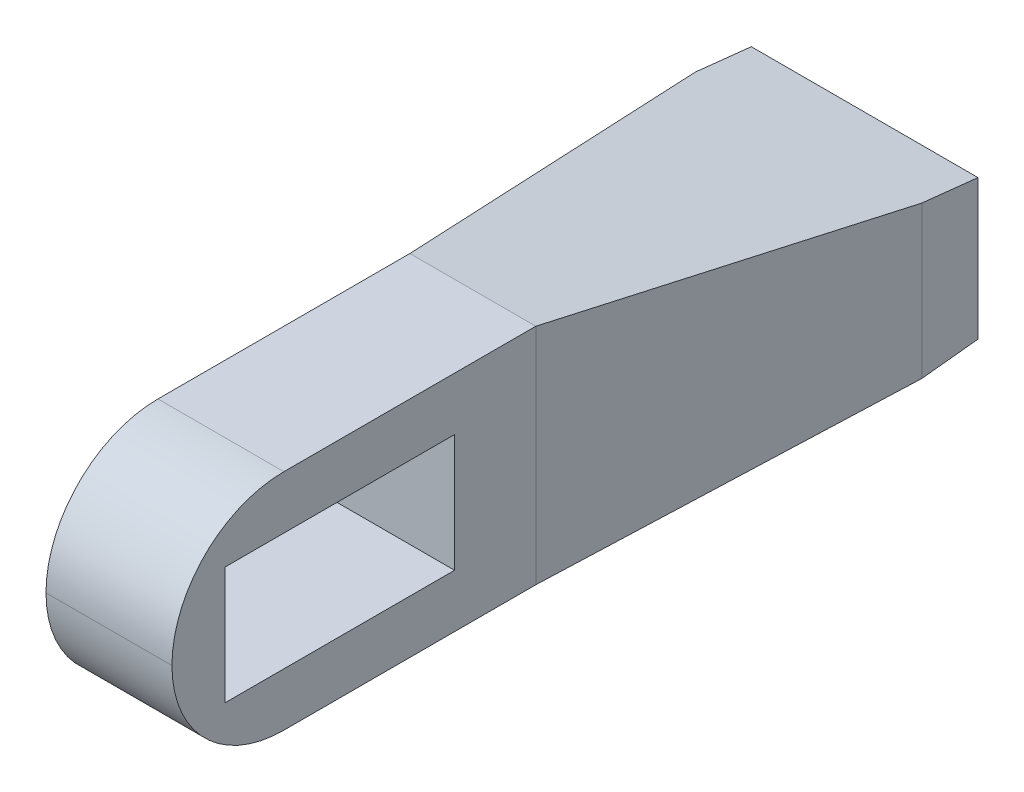
ISO-10303-21;
HEADER;
FILE_DESCRIPTION(('STEP AP214'),'2;1');
FILE_NAME('part.step','',(''),(''),'','','');
FILE_SCHEMA(('AUTOMOTIVE_DESIGN { 1 0 10303 214 1 1 1 1 }'));
ENDSEC;
DATA;
#1=APPLICATION_CONTEXT('core data for automotive mechanical design processes');
#2=APPLICATION_PROTOCOL_DEFINITION('international standard','automotive_design',2000,#1);
#3=PRODUCT_CONTEXT('',#1,'mechanical');
#4=PRODUCT('Part','Part','',(#3));
#5=PRODUCT_RELATED_PRODUCT_CATEGORY('part','',(#4));
#6=PRODUCT_DEFINITION_FORMATION('','',#4);
#7=PRODUCT_DEFINITION_CONTEXT('part definition',#1,'design');
#8=PRODUCT_DEFINITION('design','',#6,#7);
#9=PRODUCT_DEFINITION_SHAPE('','',#8);
#10=(LENGTH_UNIT() NAMED_UNIT(*) SI_UNIT(.MILLI.,.METRE.));
#11=(NAMED_UNIT(*) PLANE_ANGLE_UNIT() SI_UNIT($,.RADIAN.));
#12=(NAMED_UNIT(*) SI_UNIT($,.STERADIAN.) SOLID_ANGLE_UNIT());
#13=UNCERTAINTY_MEASURE_WITH_UNIT(LENGTH_MEASURE(1.E-05),#10,'distance_accuracy_value','');
#14=(GEOMETRIC_REPRESENTATION_CONTEXT(3) GLOBAL_UNCERTAINTY_ASSIGNED_CONTEXT((#13)) GLOBAL_UNIT_ASSIGNED_CONTEXT((#10,
#11,#12)) REPRESENTATION_CONTEXT('',''));
#15=CARTESIAN_POINT('',(0.,0.,0.));
#16=DIRECTION('',(0.,0.,1.));
#17=DIRECTION('',(1.,0.,0.));
#18=AXIS2_PLACEMENT_3D('',#15,#16,#17);
#19=CARTESIAN_POINT('',(-16.25,40.,50.));
#20=DIRECTION('',(1.,0.,0.));
#21=DIRECTION('',(0.,0.,-1.));
#22=AXIS2_PLACEMENT_3D('',#19,#20,#21);
#23=PLANE('',#22);
#24=CARTESIAN_POINT('',(-16.25,14.9999999999998,60.239120379673));
#25=DIRECTION('',(-1.,0.,0.));
#26=DIRECTION('',(0.,0.,1.));
#27=AXIS2_PLACEMENT_3D('',#24,#25,#26);
#28=CIRCLE('',#27,0.749999999999186);
#29=CARTESIAN_POINT('',(-16.25,14.9999999999998,60.9891203796721));
#30=VERTEX_POINT('',#29);
#31=EDGE_CURVE('E313',#30,#30,#28,.T.);
#32=ORIENTED_EDGE('',*,*,#31,.F.);
#33=EDGE_LOOP('',(#32));
#34=FACE_BOUND('',#33,.T.);
#35=CARTESIAN_POINT('',(-16.25,24.9999999999992,109.739120379698));
#36=DIRECTION('',(-1.,0.,0.));
#37=DIRECTION('',(0.,0.,1.));
#38=AXIS2_PLACEMENT_3D('',#35,#36,#37);
#39=CIRCLE('',#38,0.7499999999992);
#40=CARTESIAN_POINT('',(-16.25,24.9999999999992,110.489120379697));
#41=VERTEX_POINT('',#40);
#42=EDGE_CURVE('E319',#41,#41,#39,.T.);
#43=ORIENTED_EDGE('',*,*,#42,.F.);
#44=EDGE_LOOP('',(#43));
#45=FACE_BOUND('',#44,.T.);
#46=CARTESIAN_POINT('',(-16.25,14.9999999999996,109.739120379698));
#47=DIRECTION('',(-1.,0.,0.));
#48=DIRECTION('',(0.,0.,1.));
#49=AXIS2_PLACEMENT_3D('',#46,#47,#48);
#50=CIRCLE('',#49,0.7499999999992);
#51=CARTESIAN_POINT('',(-16.25,14.9999999999996,110.489120379697));
#52=VERTEX_POINT('',#51);
#53=EDGE_CURVE('E320',#52,#52,#50,.T.);
#54=ORIENTED_EDGE('',*,*,#53,.F.);
#55=EDGE_LOOP('',(#54));
#56=FACE_BOUND('',#55,.T.);
#57=CARTESIAN_POINT('',(-16.25,24.9999999999999,60.239120379673));
#58=DIRECTION('',(-1.,0.,0.));
#59=DIRECTION('',(0.,0.,1.));
#60=AXIS2_PLACEMENT_3D('',#57,#58,#59);
#61=CIRCLE('',#60,0.749999999999186);
#62=CARTESIAN_POINT('',(-16.25,24.9999999999999,60.9891203796721));
#63=VERTEX_POINT('',#62);
#64=EDGE_CURVE('E310',#63,#63,#61,.T.);
#65=ORIENTED_EDGE('',*,*,#64,.F.);
#66=EDGE_LOOP('',(#65));
#67=FACE_BOUND('',#66,.T.);
#68=DIRECTION('',(0.,0.,1.));
#69=VECTOR('',#68,1.);
#70=CARTESIAN_POINT('',(-16.25,0.,50.));
#71=LINE('',#70,#69);
#72=CARTESIAN_POINT('',(-16.25,0.,50.));
#73=VERTEX_POINT('',#72);
#74=CARTESIAN_POINT('',(-16.25,0.,95.));
#75=VERTEX_POINT('',#74);
#76=EDGE_CURVE('E209',#73,#75,#71,.T.);
#77=ORIENTED_EDGE('',*,*,#76,.T.);
#78=CARTESIAN_POINT('',(-16.25,20.,95.));
#79=DIRECTION('',(1.,0.,0.));
#80=DIRECTION('',(0.,0.,-1.));
#81=AXIS2_PLACEMENT_3D('',#78,#79,#80);
#82=CIRCLE('',#81,20.);
#83=CARTESIAN_POINT('',(-16.25,20.,115.));
#84=VERTEX_POINT('',#83);
#85=EDGE_CURVE('E190',#75,#84,#82,.F.);
#86=ORIENTED_EDGE('',*,*,#85,.T.);
#87=CARTESIAN_POINT('',(-16.25,20.,95.));
#88=DIRECTION('',(1.,0.,0.));
#89=DIRECTION('',(0.,0.,-1.));
#90=AXIS2_PLACEMENT_3D('',#87,#88,#89);
#91=CIRCLE('',#90,20.);
#92=CARTESIAN_POINT('',(-16.25,40.,95.));
#93=VERTEX_POINT('',#92);
#94=EDGE_CURVE('E188',#84,#93,#91,.F.);
#95=ORIENTED_EDGE('',*,*,#94,.T.);
#96=DIRECTION('',(0.,0.,1.));
#97=VECTOR('',#96,1.);
#98=CARTESIAN_POINT('',(-16.25,40.,50.));
#99=LINE('',#98,#97);
#100=CARTESIAN_POINT('',(-16.25,40.,50.));
#101=VERTEX_POINT('',#100);
#102=EDGE_CURVE('E219',#101,#93,#99,.T.);
#103=ORIENTED_EDGE('',*,*,#102,.F.);
#104=DIRECTION('',(0.,-1.,0.));
#105=VECTOR('',#104,1.);
#106=CARTESIAN_POINT('',(-16.25,40.,50.));
#107=LINE('',#106,#105);
#108=EDGE_CURVE('E179',#101,#73,#107,.T.);
#109=ORIENTED_EDGE('',*,*,#108,.T.);
#110=EDGE_LOOP('',(#77,#86,#95,#103,#109));
#111=FACE_BOUND('',#110,.T.);
#112=DIRECTION('',(0.,1.,0.));
#113=VECTOR('',#112,1.);
#114=CARTESIAN_POINT('',(-16.25,40.,105.511608317528));
#115=LINE('',#114,#113);
#116=CARTESIAN_POINT('',(-16.25,9.5,105.511608317528));
#117=VERTEX_POINT('',#116);
#118=CARTESIAN_POINT('',(-16.25,30.5,105.511608317528));
#119=VERTEX_POINT('',#118);
#120=EDGE_CURVE('E276',#117,#119,#115,.T.);
#121=ORIENTED_EDGE('',*,*,#120,.F.);
#122=DIRECTION('',(0.,0.,-1.));
#123=VECTOR('',#122,1.);
#124=CARTESIAN_POINT('',(-16.25,9.50000000000001,50.));
#125=LINE('',#124,#123);
#126=CARTESIAN_POINT('',(-16.25,9.50000000000001,64.5116083175281));
#127=VERTEX_POINT('',#126);
#128=EDGE_CURVE('E285',#117,#127,#125,.T.);
#129=ORIENTED_EDGE('',*,*,#128,.T.);
#130=DIRECTION('',(0.,1.,0.));
#131=VECTOR('',#130,1.);
#132=CARTESIAN_POINT('',(-16.25,40.,64.5116083175281));
#133=LINE('',#132,#131);
#134=CARTESIAN_POINT('',(-16.25,30.5,64.5116083175281));
#135=VERTEX_POINT('',#134);
#136=EDGE_CURVE('E282',#127,#135,#133,.T.);
#137=ORIENTED_EDGE('',*,*,#136,.T.);
#138=DIRECTION('',(0.,0.,-1.));
#139=VECTOR('',#138,1.);
#140=CARTESIAN_POINT('',(-16.25,30.5,50.));
#141=LINE('',#140,#139);
#142=EDGE_CURVE('E280',#119,#135,#141,.T.);
#143=ORIENTED_EDGE('',*,*,#142,.F.);
#144=EDGE_LOOP('',(#121,#129,#137,#143));
#145=FACE_BOUND('',#144,.T.);
#146=ADVANCED_FACE('F47',(#34,#45,#56,#67,#111,#145),#23,.F.);
#147=CARTESIAN_POINT('',(6.25000000000001,40.,50.));
#148=DIRECTION('',(1.,0.,0.));
#149=DIRECTION('',(0.,0.,-1.));
#150=AXIS2_PLACEMENT_3D('',#147,#148,#149);
#151=PLANE('',#150);
#152=CARTESIAN_POINT('',(6.25000000000001,20.,95.));
#153=DIRECTION('',(1.,0.,0.));
#154=DIRECTION('',(0.,0.,-1.));
#155=AXIS2_PLACEMENT_3D('',#152,#153,#154);
#156=CIRCLE('',#155,20.);
#157=CARTESIAN_POINT('',(6.25000000000001,40.,95.));
#158=VERTEX_POINT('',#157);
#159=CARTESIAN_POINT('',(6.25000000000001,20.,115.));
#160=VERTEX_POINT('',#159);
#161=EDGE_CURVE('E62',#158,#160,#156,.T.);
#162=ORIENTED_EDGE('',*,*,#161,.T.);
#163=CARTESIAN_POINT('',(6.25000000000001,20.,95.));
#164=DIRECTION('',(1.,0.,0.));
#165=DIRECTION('',(0.,0.,-1.));
#166=AXIS2_PLACEMENT_3D('',#163,#164,#165);
#167=CIRCLE('',#166,20.);
#168=CARTESIAN_POINT('',(6.25000000000001,0.,95.));
#169=VERTEX_POINT('',#168);
#170=EDGE_CURVE('E193',#160,#169,#167,.T.);
#171=ORIENTED_EDGE('',*,*,#170,.T.);
#172=DIRECTION('',(0.,0.,1.));
#173=VECTOR('',#172,1.);
#174=CARTESIAN_POINT('',(6.25000000000001,0.,50.));
#175=LINE('',#174,#173);
#176=CARTESIAN_POINT('',(6.25000000000001,0.,50.));
#177=VERTEX_POINT('',#176);
#178=EDGE_CURVE('E206',#177,#169,#175,.T.);
#179=ORIENTED_EDGE('',*,*,#178,.F.);
#180=DIRECTION('',(0.,-1.,0.));
#181=VECTOR('',#180,1.);
#182=CARTESIAN_POINT('',(6.25000000000001,40.,50.));
#183=LINE('',#182,#181);
#184=CARTESIAN_POINT('',(6.25000000000001,40.,50.));
#185=VERTEX_POINT('',#184);
#186=EDGE_CURVE('E171',#185,#177,#183,.T.);
#187=ORIENTED_EDGE('',*,*,#186,.F.);
#188=DIRECTION('',(0.,0.,1.));
#189=VECTOR('',#188,1.);
#190=CARTESIAN_POINT('',(6.25000000000001,40.,50.));
#191=LINE('',#190,#189);
#192=EDGE_CURVE('E173',#185,#158,#191,.T.);
#193=ORIENTED_EDGE('',*,*,#192,.T.);
#194=EDGE_LOOP('',(#162,#171,#179,#187,#193));
#195=FACE_BOUND('',#194,.T.);
#196=DIRECTION('',(0.,0.,-1.));
#197=VECTOR('',#196,1.);
#198=CARTESIAN_POINT('',(6.25000000000001,9.5,105.511608317528));
#199=LINE('',#198,#197);
#200=CARTESIAN_POINT('',(6.25000000000001,9.5,105.511608317528));
#201=VERTEX_POINT('',#200);
#202=CARTESIAN_POINT('',(6.25000000000001,9.50000000000001,64.5116083175281));
#203=VERTEX_POINT('',#202);
#204=EDGE_CURVE('E306',#201,#203,#199,.T.);
#205=ORIENTED_EDGE('',*,*,#204,.F.);
#206=DIRECTION('',(0.,1.,0.));
#207=VECTOR('',#206,1.);
#208=CARTESIAN_POINT('',(6.25000000000001,20.,105.511608317528));
#209=LINE('',#208,#207);
#210=CARTESIAN_POINT('',(6.25000000000001,30.5,105.511608317528));
#211=VERTEX_POINT('',#210);
#212=EDGE_CURVE('E293',#201,#211,#209,.T.);
#213=ORIENTED_EDGE('',*,*,#212,.T.);
#214=DIRECTION('',(0.,0.,-1.));
#215=VECTOR('',#214,1.);
#216=CARTESIAN_POINT('',(6.25000000000001,30.5,105.511608317528));
#217=LINE('',#216,#215);
#218=CARTESIAN_POINT('',(6.25000000000001,30.5,64.5116083175281));
#219=VERTEX_POINT('',#218);
#220=EDGE_CURVE('E300',#211,#219,#217,.T.);
#221=ORIENTED_EDGE('',*,*,#220,.T.);
#222=DIRECTION('',(0.,1.,0.));
#223=VECTOR('',#222,1.);
#224=CARTESIAN_POINT('',(6.25000000000001,9.50000000000001,64.5116083175281));
#225=LINE('',#224,#223);
#226=EDGE_CURVE('E303',#203,#219,#225,.T.);
#227=ORIENTED_EDGE('',*,*,#226,.F.);
#228=EDGE_LOOP('',(#205,#213,#221,#227));
#229=FACE_BOUND('',#228,.T.);
#230=ADVANCED_FACE('F216',(#195,#229),#151,.T.);
#231=CARTESIAN_POINT('',(-25.25,40.,-20.));
#232=DIRECTION('',(1.,0.,0.));
#233=DIRECTION('',(0.,0.,-1.));
#234=AXIS2_PLACEMENT_3D('',#231,#232,#233);
#235=PLANE('',#234);
#236=DIRECTION('',(0.,-1.,0.));
#237=VECTOR('',#236,1.);
#238=CARTESIAN_POINT('',(-25.25,40.,-10.));
#239=LINE('',#238,#237);
#240=CARTESIAN_POINT('',(-25.25,33.5714285714286,-10.));
#241=VERTEX_POINT('',#240);
#242=CARTESIAN_POINT('',(-25.25,6.42857142857143,-10.));
#243=VERTEX_POINT('',#242);
#244=EDGE_CURVE('E182',#241,#243,#239,.T.);
#245=ORIENTED_EDGE('',*,*,#244,.F.);
#246=DIRECTION('',(0.,0.106533123634265,0.994309153919809));
#247=VECTOR('',#246,1.);
#248=CARTESIAN_POINT('',(-25.25,32.5,-20.));
#249=LINE('',#248,#247);
#250=CARTESIAN_POINT('',(-25.25,32.5,-20.));
#251=VERTEX_POINT('',#250);
#252=EDGE_CURVE('E153',#251,#241,#249,.T.);
#253=ORIENTED_EDGE('',*,*,#252,.F.);
#254=DIRECTION('',(0.,-1.,0.));
#255=VECTOR('',#254,1.);
#256=CARTESIAN_POINT('',(-25.25,40.,-20.));
#257=LINE('',#256,#255);
#258=CARTESIAN_POINT('',(-25.25,7.5,-20.));
#259=VERTEX_POINT('',#258);
#260=EDGE_CURVE('E163',#251,#259,#257,.T.);
#261=ORIENTED_EDGE('',*,*,#260,.T.);
#262=DIRECTION('',(0.,0.106533123634265,-0.994309153919809));
#263=VECTOR('',#262,1.);
#264=CARTESIAN_POINT('',(-25.25,7.5,-20.));
#265=LINE('',#264,#263);
#266=EDGE_CURVE('E339',#243,#259,#265,.T.);
#267=ORIENTED_EDGE('',*,*,#266,.F.);
#268=EDGE_LOOP('',(#245,#253,#261,#267));
#269=FACE_BOUND('',#268,.T.);
#270=ADVANCED_FACE('F351',(#269),#235,.F.);
#271=CARTESIAN_POINT('',(-25.25,40.,-10.));
#272=DIRECTION('',(0.988936352868298,0.,-0.148340452930245));
#273=DIRECTION('',(-0.148340452930245,0.,-0.988936352868298));
#274=AXIS2_PLACEMENT_3D('',#271,#272,#273);
#275=PLANE('',#274);
#276=ORIENTED_EDGE('',*,*,#108,.F.);
#277=DIRECTION('',(-0.14751469157255,-0.105367636837535,-0.98343127715033));
#278=VECTOR('',#277,1.);
#279=CARTESIAN_POINT('',(-25.1500789499655,33.6428007500247,-9.33385966643639));
#280=LINE('',#279,#278);
#281=EDGE_CURVE('E199',#101,#241,#280,.T.);
#282=ORIENTED_EDGE('',*,*,#281,.T.);
#283=ORIENTED_EDGE('',*,*,#244,.T.);
#284=DIRECTION('',(0.14751469157255,-0.105367636837535,0.98343127715033));
#285=VECTOR('',#284,1.);
#286=CARTESIAN_POINT('',(-25.7718099279582,6.8012928056844,-13.4787328530544));
#287=LINE('',#286,#285);
#288=EDGE_CURVE('E335',#243,#73,#287,.T.);
#289=ORIENTED_EDGE('',*,*,#288,.T.);
#290=EDGE_LOOP('',(#276,#282,#283,#289));
#291=FACE_BOUND('',#290,.T.);
#292=ADVANCED_FACE('F348',(#291),#275,.F.);
#293=CARTESIAN_POINT('',(6.25000000000001,40.,50.));
#294=DIRECTION('',(-0.988936352868299,0.,-0.148340452930237));
#295=DIRECTION('',(-0.148340452930237,0.,0.988936352868299));
#296=AXIS2_PLACEMENT_3D('',#293,#294,#295);
#297=PLANE('',#296);
#298=DIRECTION('',(0.,-1.,0.));
#299=VECTOR('',#298,1.);
#300=CARTESIAN_POINT('',(15.2499999999995,40.,-10.));
#301=LINE('',#300,#299);
#302=CARTESIAN_POINT('',(15.25,33.5714285714286,-9.99999999999999));
#303=VERTEX_POINT('',#302);
#304=CARTESIAN_POINT('',(15.25,6.42857142857143,-10.));
#305=VERTEX_POINT('',#304);
#306=EDGE_CURVE('E169',#303,#305,#301,.T.);
#307=ORIENTED_EDGE('',*,*,#306,.F.);
#308=DIRECTION('',(-0.147514691572542,0.105367636837535,0.983431277150331));
#309=VECTOR('',#308,1.);
#310=CARTESIAN_POINT('',(6.25000000000001,40.,50.));
#311=LINE('',#310,#309);
#312=EDGE_CURVE('E148',#303,#185,#311,.T.);
#313=ORIENTED_EDGE('',*,*,#312,.T.);
#314=ORIENTED_EDGE('',*,*,#186,.T.);
#315=DIRECTION('',(0.147514691572542,0.105367636837535,-0.983431277150331));
#316=VECTOR('',#315,1.);
#317=CARTESIAN_POINT('',(6.87173097799267,0.444093555709069,45.855126813382));
#318=LINE('',#317,#316);
#319=EDGE_CURVE('E164',#177,#305,#318,.T.);
#320=ORIENTED_EDGE('',*,*,#319,.T.);
#321=EDGE_LOOP('',(#307,#313,#314,#320));
#322=FACE_BOUND('',#321,.T.);
#323=ADVANCED_FACE('F215',(#322),#297,.F.);
#324=CARTESIAN_POINT('',(15.25,40.,-20.));
#325=DIRECTION('',(1.,0.,0.));
#326=DIRECTION('',(0.,0.,-1.));
#327=AXIS2_PLACEMENT_3D('',#324,#325,#326);
#328=PLANE('',#327);
#329=DIRECTION('',(0.,0.106533123634265,0.994309153919809));
#330=VECTOR('',#329,1.);
#331=CARTESIAN_POINT('',(15.25,32.5,-20.));
#332=LINE('',#331,#330);
#333=CARTESIAN_POINT('',(15.25,32.5,-20.));
#334=VERTEX_POINT('',#333);
#335=EDGE_CURVE('E142',#334,#303,#332,.T.);
#336=ORIENTED_EDGE('',*,*,#335,.T.);
#337=ORIENTED_EDGE('',*,*,#306,.T.);
#338=DIRECTION('',(0.,0.106533123634265,-0.994309153919809));
#339=VECTOR('',#338,1.);
#340=CARTESIAN_POINT('',(15.25,7.5,-20.));
#341=LINE('',#340,#339);
#342=CARTESIAN_POINT('',(15.25,7.5,-20.));
#343=VERTEX_POINT('',#342);
#344=EDGE_CURVE('E168',#305,#343,#341,.T.);
#345=ORIENTED_EDGE('',*,*,#344,.T.);
#346=DIRECTION('',(0.,-1.,0.));
#347=VECTOR('',#346,1.);
#348=CARTESIAN_POINT('',(15.25,40.,-20.));
#349=LINE('',#348,#347);
#350=EDGE_CURVE('E161',#334,#343,#349,.T.);
#351=ORIENTED_EDGE('',*,*,#350,.F.);
#352=EDGE_LOOP('',(#336,#337,#345,#351));
#353=FACE_BOUND('',#352,.T.);
#354=ADVANCED_FACE('F167',(#353),#328,.T.);
#355=CARTESIAN_POINT('',(-25.25,40.,-20.));
#356=DIRECTION('',(0.,0.,-1.));
#357=DIRECTION('',(-1.,0.,0.));
#358=AXIS2_PLACEMENT_3D('',#355,#356,#357);
#359=PLANE('',#358);
#360=DIRECTION('',(-1.,0.,0.));
#361=VECTOR('',#360,1.);
#362=CARTESIAN_POINT('',(15.25,32.5,-20.));
#363=LINE('',#362,#361);
#364=EDGE_CURVE('E145',#334,#251,#363,.T.);
#365=ORIENTED_EDGE('',*,*,#364,.F.);
#366=ORIENTED_EDGE('',*,*,#350,.T.);
#367=DIRECTION('',(-1.,0.,0.));
#368=VECTOR('',#367,1.);
#369=CARTESIAN_POINT('',(15.25,7.5,-20.));
#370=LINE('',#369,#368);
#371=EDGE_CURVE('E340',#343,#259,#370,.T.);
#372=ORIENTED_EDGE('',*,*,#371,.T.);
#373=ORIENTED_EDGE('',*,*,#260,.F.);
#374=EDGE_LOOP('',(#365,#366,#372,#373));
#375=FACE_BOUND('',#374,.T.);
#376=CARTESIAN_POINT('',(-5.,20.,-20.));
#377=DIRECTION('',(0.,0.,-1.));
#378=DIRECTION('',(-1.,0.,0.));
#379=AXIS2_PLACEMENT_3D('',#376,#377,#378);
#380=CIRCLE('',#379,2.75);
#381=CARTESIAN_POINT('',(-7.75,20.,-20.));
#382=VERTEX_POINT('',#381);
#383=EDGE_CURVE('E273',#382,#382,#380,.T.);
#384=ORIENTED_EDGE('',*,*,#383,.F.);
#385=EDGE_LOOP('',(#384));
#386=FACE_BOUND('',#385,.T.);
#387=CARTESIAN_POINT('',(10.0000000000003,24.9999999999998,-20.));
#388=DIRECTION('',(0.,0.,-1.));
#389=DIRECTION('',(-1.,0.,0.));
#390=AXIS2_PLACEMENT_3D('',#387,#388,#389);
#391=CIRCLE('',#390,0.750000000000002);
#392=CARTESIAN_POINT('',(9.25000000000026,24.9999999999998,-20.));
#393=VERTEX_POINT('',#392);
#394=EDGE_CURVE('E228',#393,#393,#391,.T.);
#395=ORIENTED_EDGE('',*,*,#394,.F.);
#396=EDGE_LOOP('',(#395));
#397=FACE_BOUND('',#396,.T.);
#398=CARTESIAN_POINT('',(2.53269627492614E-13,24.9999999999999,-20.));
#399=DIRECTION('',(0.,0.,-1.));
#400=DIRECTION('',(-1.,0.,0.));
#401=AXIS2_PLACEMENT_3D('',#398,#399,#400);
#402=CIRCLE('',#401,0.750000000000001);
#403=CARTESIAN_POINT('',(-0.749999999999747,24.9999999999999,-20.));
#404=VERTEX_POINT('',#403);
#405=EDGE_CURVE('E247',#404,#404,#402,.T.);
#406=ORIENTED_EDGE('',*,*,#405,.F.);
#407=EDGE_LOOP('',(#406));
#408=FACE_BOUND('',#407,.T.);
#409=CARTESIAN_POINT('',(2.18575157973078E-13,15.,-20.));
#410=DIRECTION('',(0.,0.,-1.));
#411=DIRECTION('',(-1.,0.,0.));
#412=AXIS2_PLACEMENT_3D('',#409,#410,#411);
#413=CIRCLE('',#412,0.750000000000001);
#414=CARTESIAN_POINT('',(-0.749999999999782,15.,-20.));
#415=VERTEX_POINT('',#414);
#416=EDGE_CURVE('E241',#415,#415,#413,.T.);
#417=ORIENTED_EDGE('',*,*,#416,.F.);
#418=EDGE_LOOP('',(#417));
#419=FACE_BOUND('',#418,.T.);
#420=CARTESIAN_POINT('',(-9.99999999999995,15.,-20.));
#421=DIRECTION('',(0.,0.,-1.));
#422=DIRECTION('',(-1.,0.,0.));
#423=AXIS2_PLACEMENT_3D('',#420,#421,#422);
#424=CIRCLE('',#423,0.75);
#425=CARTESIAN_POINT('',(-10.75,15.,-20.));
#426=VERTEX_POINT('',#425);
#427=EDGE_CURVE('E234',#426,#426,#424,.T.);
#428=ORIENTED_EDGE('',*,*,#427,.F.);
#429=EDGE_LOOP('',(#428));
#430=FACE_BOUND('',#429,.T.);
#431=CARTESIAN_POINT('',(-19.9999999999999,25.0000000000002,-20.));
#432=DIRECTION('',(0.,0.,-1.));
#433=DIRECTION('',(-1.,0.,0.));
#434=AXIS2_PLACEMENT_3D('',#431,#432,#433);
#435=CIRCLE('',#434,0.750000000000002);
#436=CARTESIAN_POINT('',(-20.7499999999999,25.0000000000002,-20.));
#437=VERTEX_POINT('',#436);
#438=EDGE_CURVE('E259',#437,#437,#435,.T.);
#439=ORIENTED_EDGE('',*,*,#438,.F.);
#440=EDGE_LOOP('',(#439));
#441=FACE_BOUND('',#440,.T.);
#442=CARTESIAN_POINT('',(-19.9999999999999,15.0000000000002,-20.));
#443=DIRECTION('',(0.,0.,-1.));
#444=DIRECTION('',(-1.,0.,0.));
#445=AXIS2_PLACEMENT_3D('',#442,#443,#444);
#446=CIRCLE('',#445,0.750000000000002);
#447=CARTESIAN_POINT('',(-20.7499999999999,15.0000000000002,-20.));
#448=VERTEX_POINT('',#447);
#449=EDGE_CURVE('E258',#448,#448,#446,.T.);
#450=ORIENTED_EDGE('',*,*,#449,.F.);
#451=EDGE_LOOP('',(#450));
#452=FACE_BOUND('',#451,.T.);
#453=CARTESIAN_POINT('',(-9.99999999999992,25.,-20.));
#454=DIRECTION('',(0.,0.,-1.));
#455=DIRECTION('',(-1.,0.,0.));
#456=AXIS2_PLACEMENT_3D('',#453,#454,#455);
#457=CIRCLE('',#456,0.75);
#458=CARTESIAN_POINT('',(-10.7499999999999,25.,-20.));
#459=VERTEX_POINT('',#458);
#460=EDGE_CURVE('E235',#459,#459,#457,.T.);
#461=ORIENTED_EDGE('',*,*,#460,.F.);
#462=EDGE_LOOP('',(#461));
#463=FACE_BOUND('',#462,.T.);
#464=CARTESIAN_POINT('',(10.0000000000002,14.9999999999998,-20.));
#465=DIRECTION('',(0.,0.,-1.));
#466=DIRECTION('',(-1.,0.,0.));
#467=AXIS2_PLACEMENT_3D('',#464,#465,#466);
#468=CIRCLE('',#467,0.750000000000002);
#469=CARTESIAN_POINT('',(9.25000000000022,14.9999999999998,-20.));
#470=VERTEX_POINT('',#469);
#471=EDGE_CURVE('E225',#470,#470,#468,.T.);
#472=ORIENTED_EDGE('',*,*,#471,.F.);
#473=EDGE_LOOP('',(#472));
#474=FACE_BOUND('',#473,.T.);
#475=ADVANCED_FACE('F158',(#375,#386,#397,#408,#419,#430,#441,#452,#463,#474),#359,.T.);
#476=CARTESIAN_POINT('',(0.,40.,0.));
#477=DIRECTION('',(0.,1.,0.));
#478=DIRECTION('',(0.,0.,1.));
#479=AXIS2_PLACEMENT_3D('',#476,#477,#478);
#480=PLANE('',#479);
#481=DIRECTION('',(1.,0.,0.));
#482=VECTOR('',#481,1.);
#483=CARTESIAN_POINT('',(0.,40.,50.));
#484=LINE('',#483,#482);
#485=EDGE_CURVE('E11',#101,#185,#484,.T.);
#486=ORIENTED_EDGE('',*,*,#485,.F.);
#487=ORIENTED_EDGE('',*,*,#102,.T.);
#488=DIRECTION('',(1.,0.,0.));
#489=VECTOR('',#488,1.);
#490=CARTESIAN_POINT('',(0.,40.,95.));
#491=LINE('',#490,#489);
#492=EDGE_CURVE('E70',#93,#158,#491,.T.);
#493=ORIENTED_EDGE('',*,*,#492,.T.);
#494=ORIENTED_EDGE('',*,*,#192,.F.);
#495=EDGE_LOOP('',(#486,#487,#493,#494));
#496=FACE_BOUND('',#495,.T.);
#497=ADVANCED_FACE('F356',(#496),#480,.T.);
#498=CARTESIAN_POINT('',(0.,0.,0.));
#499=DIRECTION('',(0.,1.,0.));
#500=DIRECTION('',(0.,0.,1.));
#501=AXIS2_PLACEMENT_3D('',#498,#499,#500);
#502=PLANE('',#501);
#503=ORIENTED_EDGE('',*,*,#76,.F.);
#504=DIRECTION('',(1.,0.,0.));
#505=VECTOR('',#504,1.);
#506=CARTESIAN_POINT('',(0.,0.,50.));
#507=LINE('',#506,#505);
#508=EDGE_CURVE('E55',#73,#177,#507,.T.);
#509=ORIENTED_EDGE('',*,*,#508,.T.);
#510=ORIENTED_EDGE('',*,*,#178,.T.);
#511=DIRECTION('',(-1.,0.,0.));
#512=VECTOR('',#511,1.);
#513=CARTESIAN_POINT('',(-16.25,0.,95.));
#514=LINE('',#513,#512);
#515=EDGE_CURVE('E185',#169,#75,#514,.T.);
#516=ORIENTED_EDGE('',*,*,#515,.T.);
#517=EDGE_LOOP('',(#503,#509,#510,#516));
#518=FACE_BOUND('',#517,.T.);
#519=ADVANCED_FACE('F204',(#518),#502,.F.);
#520=CARTESIAN_POINT('',(10.0000000000002,14.9999999999998,-17.));
#521=DIRECTION('',(0.,0.,-1.));
#522=DIRECTION('',(-1.,0.,0.));
#523=AXIS2_PLACEMENT_3D('',#520,#521,#522);
#524=CYLINDRICAL_SURFACE('',#523,0.750000000000002);
#525=CARTESIAN_POINT('',(10.0000000000002,14.9999999999998,-17.));
#526=DIRECTION('',(0.,0.,-1.));
#527=DIRECTION('',(-1.,0.,0.));
#528=AXIS2_PLACEMENT_3D('',#525,#526,#527);
#529=CIRCLE('',#528,0.750000000000002);
#530=CARTESIAN_POINT('',(9.25000000000022,14.9999999999998,-17.));
#531=VERTEX_POINT('',#530);
#532=EDGE_CURVE('E221',#531,#531,#529,.T.);
#533=ORIENTED_EDGE('',*,*,#532,.F.);
#534=EDGE_LOOP('',(#533));
#535=FACE_BOUND('',#534,.T.);
#536=ORIENTED_EDGE('',*,*,#471,.T.);
#537=EDGE_LOOP('',(#536));
#538=FACE_BOUND('',#537,.T.);
#539=ADVANCED_FACE('F423',(#535,#538),#524,.F.);
#540=CARTESIAN_POINT('',(10.0000000000002,14.9999999999998,-17.));
#541=DIRECTION('',(0.,0.,-1.));
#542=DIRECTION('',(-1.,0.,0.));
#543=AXIS2_PLACEMENT_3D('',#540,#541,#542);
#544=PLANE('',#543);
#545=ORIENTED_EDGE('',*,*,#532,.T.);
#546=EDGE_LOOP('',(#545));
#547=FACE_BOUND('',#546,.T.);
#548=ADVANCED_FACE('F716',(#547),#544,.T.);
#549=CARTESIAN_POINT('',(-9.99999999999992,25.,-17.));
#550=DIRECTION('',(0.,0.,-1.));
#551=DIRECTION('',(-1.,0.,0.));
#552=AXIS2_PLACEMENT_3D('',#549,#550,#551);
#553=CYLINDRICAL_SURFACE('',#552,0.75);
#554=CARTESIAN_POINT('',(-9.99999999999992,25.,-17.));
#555=DIRECTION('',(0.,0.,-1.));
#556=DIRECTION('',(-1.,0.,0.));
#557=AXIS2_PLACEMENT_3D('',#554,#555,#556);
#558=CIRCLE('',#557,0.75);
#559=CARTESIAN_POINT('',(-10.7499999999999,25.,-17.));
#560=VERTEX_POINT('',#559);
#561=EDGE_CURVE('E262',#560,#560,#558,.T.);
#562=ORIENTED_EDGE('',*,*,#561,.F.);
#563=EDGE_LOOP('',(#562));
#564=FACE_BOUND('',#563,.T.);
#565=ORIENTED_EDGE('',*,*,#460,.T.);
#566=EDGE_LOOP('',(#565));
#567=FACE_BOUND('',#566,.T.);
#568=ADVANCED_FACE('F707',(#564,#567),#553,.F.);
#569=CARTESIAN_POINT('',(-9.99999999999992,25.,-17.));
#570=DIRECTION('',(0.,0.,-1.));
#571=DIRECTION('',(-1.,0.,0.));
#572=AXIS2_PLACEMENT_3D('',#569,#570,#571);
#573=PLANE('',#572);
#574=ORIENTED_EDGE('',*,*,#561,.T.);
#575=EDGE_LOOP('',(#574));
#576=FACE_BOUND('',#575,.T.);
#577=ADVANCED_FACE('F698',(#576),#573,.T.);
#578=CARTESIAN_POINT('',(-19.9999999999999,15.0000000000002,-17.));
#579=DIRECTION('',(0.,0.,-1.));
#580=DIRECTION('',(-1.,0.,0.));
#581=AXIS2_PLACEMENT_3D('',#578,#579,#580);
#582=CYLINDRICAL_SURFACE('',#581,0.750000000000002);
#583=CARTESIAN_POINT('',(-19.9999999999999,15.0000000000002,-17.));
#584=DIRECTION('',(0.,0.,-1.));
#585=DIRECTION('',(-1.,0.,0.));
#586=AXIS2_PLACEMENT_3D('',#583,#584,#585);
#587=CIRCLE('',#586,0.750000000000002);
#588=CARTESIAN_POINT('',(-20.7499999999999,15.0000000000002,-17.));
#589=VERTEX_POINT('',#588);
#590=EDGE_CURVE('E255',#589,#589,#587,.T.);
#591=ORIENTED_EDGE('',*,*,#590,.F.);
#592=EDGE_LOOP('',(#591));
#593=FACE_BOUND('',#592,.T.);
#594=ORIENTED_EDGE('',*,*,#449,.T.);
#595=EDGE_LOOP('',(#594));
#596=FACE_BOUND('',#595,.T.);
#597=ADVANCED_FACE('F689',(#593,#596),#582,.F.);
#598=CARTESIAN_POINT('',(-19.9999999999999,15.0000000000002,-17.));
#599=DIRECTION('',(0.,0.,-1.));
#600=DIRECTION('',(-1.,0.,0.));
#601=AXIS2_PLACEMENT_3D('',#598,#599,#600);
#602=PLANE('',#601);
#603=ORIENTED_EDGE('',*,*,#590,.T.);
#604=EDGE_LOOP('',(#603));
#605=FACE_BOUND('',#604,.T.);
#606=ADVANCED_FACE('F680',(#605),#602,.T.);
#607=CARTESIAN_POINT('',(-19.9999999999999,25.0000000000002,-17.));
#608=DIRECTION('',(0.,0.,-1.));
#609=DIRECTION('',(-1.,0.,0.));
#610=AXIS2_PLACEMENT_3D('',#607,#608,#609);
#611=CYLINDRICAL_SURFACE('',#610,0.750000000000002);
#612=CARTESIAN_POINT('',(-19.9999999999999,25.0000000000002,-17.));
#613=DIRECTION('',(0.,0.,-1.));
#614=DIRECTION('',(-1.,0.,0.));
#615=AXIS2_PLACEMENT_3D('',#612,#613,#614);
#616=CIRCLE('',#615,0.750000000000002);
#617=CARTESIAN_POINT('',(-20.7499999999999,25.0000000000002,-17.));
#618=VERTEX_POINT('',#617);
#619=EDGE_CURVE('E267',#618,#618,#616,.T.);
#620=ORIENTED_EDGE('',*,*,#619,.F.);
#621=EDGE_LOOP('',(#620));
#622=FACE_BOUND('',#621,.T.);
#623=ORIENTED_EDGE('',*,*,#438,.T.);
#624=EDGE_LOOP('',(#623));
#625=FACE_BOUND('',#624,.T.);
#626=ADVANCED_FACE('F671',(#622,#625),#611,.F.);
#627=CARTESIAN_POINT('',(-19.9999999999999,25.0000000000002,-17.));
#628=DIRECTION('',(0.,0.,-1.));
#629=DIRECTION('',(-1.,0.,0.));
#630=AXIS2_PLACEMENT_3D('',#627,#628,#629);
#631=PLANE('',#630);
#632=ORIENTED_EDGE('',*,*,#619,.T.);
#633=EDGE_LOOP('',(#632));
#634=FACE_BOUND('',#633,.T.);
#635=ADVANCED_FACE('F662',(#634),#631,.T.);
#636=CARTESIAN_POINT('',(-9.99999999999995,15.,-17.));
#637=DIRECTION('',(0.,0.,-1.));
#638=DIRECTION('',(-1.,0.,0.));
#639=AXIS2_PLACEMENT_3D('',#636,#637,#638);
#640=CYLINDRICAL_SURFACE('',#639,0.75);
#641=CARTESIAN_POINT('',(-9.99999999999995,15.,-17.));
#642=DIRECTION('',(0.,0.,-1.));
#643=DIRECTION('',(-1.,0.,0.));
#644=AXIS2_PLACEMENT_3D('',#641,#642,#643);
#645=CIRCLE('',#644,0.75);
#646=CARTESIAN_POINT('',(-10.75,15.,-17.));
#647=VERTEX_POINT('',#646);
#648=EDGE_CURVE('E231',#647,#647,#645,.T.);
#649=ORIENTED_EDGE('',*,*,#648,.F.);
#650=EDGE_LOOP('',(#649));
#651=FACE_BOUND('',#650,.T.);
#652=ORIENTED_EDGE('',*,*,#427,.T.);
#653=EDGE_LOOP('',(#652));
#654=FACE_BOUND('',#653,.T.);
#655=ADVANCED_FACE('F653',(#651,#654),#640,.F.);
#656=CARTESIAN_POINT('',(-9.99999999999995,15.,-17.));
#657=DIRECTION('',(0.,0.,-1.));
#658=DIRECTION('',(-1.,0.,0.));
#659=AXIS2_PLACEMENT_3D('',#656,#657,#658);
#660=PLANE('',#659);
#661=ORIENTED_EDGE('',*,*,#648,.T.);
#662=EDGE_LOOP('',(#661));
#663=FACE_BOUND('',#662,.T.);
#664=ADVANCED_FACE('F644',(#663),#660,.T.);
#665=CARTESIAN_POINT('',(2.18575157973078E-13,15.,-17.));
#666=DIRECTION('',(0.,0.,-1.));
#667=DIRECTION('',(-1.,0.,0.));
#668=AXIS2_PLACEMENT_3D('',#665,#666,#667);
#669=CYLINDRICAL_SURFACE('',#668,0.750000000000001);
#670=CARTESIAN_POINT('',(2.18575157973078E-13,15.,-17.));
#671=DIRECTION('',(0.,0.,-1.));
#672=DIRECTION('',(-1.,0.,0.));
#673=AXIS2_PLACEMENT_3D('',#670,#671,#672);
#674=CIRCLE('',#673,0.750000000000001);
#675=CARTESIAN_POINT('',(-0.749999999999782,15.,-17.));
#676=VERTEX_POINT('',#675);
#677=EDGE_CURVE('E238',#676,#676,#674,.T.);
#678=ORIENTED_EDGE('',*,*,#677,.F.);
#679=EDGE_LOOP('',(#678));
#680=FACE_BOUND('',#679,.T.);
#681=ORIENTED_EDGE('',*,*,#416,.T.);
#682=EDGE_LOOP('',(#681));
#683=FACE_BOUND('',#682,.T.);
#684=ADVANCED_FACE('F635',(#680,#683),#669,.F.);
#685=CARTESIAN_POINT('',(2.18575157973078E-13,15.,-17.));
#686=DIRECTION('',(0.,0.,-1.));
#687=DIRECTION('',(-1.,0.,0.));
#688=AXIS2_PLACEMENT_3D('',#685,#686,#687);
#689=PLANE('',#688);
#690=ORIENTED_EDGE('',*,*,#677,.T.);
#691=EDGE_LOOP('',(#690));
#692=FACE_BOUND('',#691,.T.);
#693=ADVANCED_FACE('F626',(#692),#689,.T.);
#694=CARTESIAN_POINT('',(2.53269627492614E-13,24.9999999999999,-17.));
#695=DIRECTION('',(0.,0.,-1.));
#696=DIRECTION('',(-1.,0.,0.));
#697=AXIS2_PLACEMENT_3D('',#694,#695,#696);
#698=CYLINDRICAL_SURFACE('',#697,0.750000000000001);
#699=CARTESIAN_POINT('',(2.53269627492614E-13,24.9999999999999,-17.));
#700=DIRECTION('',(0.,0.,-1.));
#701=DIRECTION('',(-1.,0.,0.));
#702=AXIS2_PLACEMENT_3D('',#699,#700,#701);
#703=CIRCLE('',#702,0.750000000000001);
#704=CARTESIAN_POINT('',(-0.749999999999747,24.9999999999999,-17.));
#705=VERTEX_POINT('',#704);
#706=EDGE_CURVE('E244',#705,#705,#703,.T.);
#707=ORIENTED_EDGE('',*,*,#706,.F.);
#708=EDGE_LOOP('',(#707));
#709=FACE_BOUND('',#708,.T.);
#710=ORIENTED_EDGE('',*,*,#405,.T.);
#711=EDGE_LOOP('',(#710));
#712=FACE_BOUND('',#711,.T.);
#713=ADVANCED_FACE('F617',(#709,#712),#698,.F.);
#714=CARTESIAN_POINT('',(2.53269627492614E-13,24.9999999999999,-17.));
#715=DIRECTION('',(0.,0.,-1.));
#716=DIRECTION('',(-1.,0.,0.));
#717=AXIS2_PLACEMENT_3D('',#714,#715,#716);
#718=PLANE('',#717);
#719=ORIENTED_EDGE('',*,*,#706,.T.);
#720=EDGE_LOOP('',(#719));
#721=FACE_BOUND('',#720,.T.);
#722=ADVANCED_FACE('F608',(#721),#718,.T.);
#723=CARTESIAN_POINT('',(10.0000000000003,24.9999999999998,-17.));
#724=DIRECTION('',(0.,0.,-1.));
#725=DIRECTION('',(-1.,0.,0.));
#726=AXIS2_PLACEMENT_3D('',#723,#724,#725);
#727=CYLINDRICAL_SURFACE('',#726,0.750000000000002);
#728=CARTESIAN_POINT('',(10.0000000000003,24.9999999999998,-17.));
#729=DIRECTION('',(0.,0.,-1.));
#730=DIRECTION('',(-1.,0.,0.));
#731=AXIS2_PLACEMENT_3D('',#728,#729,#730);
#732=CIRCLE('',#731,0.750000000000002);
#733=CARTESIAN_POINT('',(9.25000000000026,24.9999999999998,-17.));
#734=VERTEX_POINT('',#733);
#735=EDGE_CURVE('E250',#734,#734,#732,.T.);
#736=ORIENTED_EDGE('',*,*,#735,.F.);
#737=EDGE_LOOP('',(#736));
#738=FACE_BOUND('',#737,.T.);
#739=ORIENTED_EDGE('',*,*,#394,.T.);
#740=EDGE_LOOP('',(#739));
#741=FACE_BOUND('',#740,.T.);
#742=ADVANCED_FACE('F599',(#738,#741),#727,.F.);
#743=CARTESIAN_POINT('',(10.0000000000003,24.9999999999998,-17.));
#744=DIRECTION('',(0.,0.,-1.));
#745=DIRECTION('',(-1.,0.,0.));
#746=AXIS2_PLACEMENT_3D('',#743,#744,#745);
#747=PLANE('',#746);
#748=ORIENTED_EDGE('',*,*,#735,.T.);
#749=EDGE_LOOP('',(#748));
#750=FACE_BOUND('',#749,.T.);
#751=ADVANCED_FACE('F590',(#750),#747,.T.);
#752=CARTESIAN_POINT('',(-5.,20.,-24.));
#753=DIRECTION('',(0.,0.,1.));
#754=DIRECTION('',(1.,0.,0.));
#755=AXIS2_PLACEMENT_3D('',#752,#753,#754);
#756=CYLINDRICAL_SURFACE('',#755,2.75);
#757=CARTESIAN_POINT('',(-5.,20.,-24.));
#758=DIRECTION('',(0.,0.,-1.));
#759=DIRECTION('',(-1.,0.,0.));
#760=AXIS2_PLACEMENT_3D('',#757,#758,#759);
#761=CIRCLE('',#760,2.75);
#762=CARTESIAN_POINT('',(-7.75,20.,-24.));
#763=VERTEX_POINT('',#762);
#764=EDGE_CURVE('E270',#763,#763,#761,.T.);
#765=ORIENTED_EDGE('',*,*,#764,.F.);
#766=EDGE_LOOP('',(#765));
#767=FACE_BOUND('',#766,.T.);
#768=ORIENTED_EDGE('',*,*,#383,.T.);
#769=EDGE_LOOP('',(#768));
#770=FACE_BOUND('',#769,.T.);
#771=ADVANCED_FACE('F581',(#767,#770),#756,.T.);
#772=CARTESIAN_POINT('',(-5.,20.,-24.));
#773=DIRECTION('',(0.,0.,-1.));
#774=DIRECTION('',(-1.,0.,0.));
#775=AXIS2_PLACEMENT_3D('',#772,#773,#774);
#776=PLANE('',#775);
#777=ORIENTED_EDGE('',*,*,#764,.T.);
#778=EDGE_LOOP('',(#777));
#779=FACE_BOUND('',#778,.T.);
#780=ADVANCED_FACE('F563',(#779),#776,.T.);
#781=CARTESIAN_POINT('',(-34.25,20.,105.511608317528));
#782=DIRECTION('',(0.,0.,-1.));
#783=DIRECTION('',(-1.,0.,0.));
#784=AXIS2_PLACEMENT_3D('',#781,#782,#783);
#785=PLANE('',#784);
#786=ORIENTED_EDGE('',*,*,#120,.T.);
#787=DIRECTION('',(1.,0.,0.));
#788=VECTOR('',#787,1.);
#789=CARTESIAN_POINT('',(-34.25,30.5,105.511608317528));
#790=LINE('',#789,#788);
#791=EDGE_CURVE('E288',#119,#211,#790,.T.);
#792=ORIENTED_EDGE('',*,*,#791,.T.);
#793=ORIENTED_EDGE('',*,*,#212,.F.);
#794=DIRECTION('',(1.,0.,0.));
#795=VECTOR('',#794,1.);
#796=CARTESIAN_POINT('',(-34.25,9.5,105.511608317528));
#797=LINE('',#796,#795);
#798=EDGE_CURVE('E289',#117,#201,#797,.T.);
#799=ORIENTED_EDGE('',*,*,#798,.F.);
#800=EDGE_LOOP('',(#786,#792,#793,#799));
#801=FACE_BOUND('',#800,.T.);
#802=ADVANCED_FACE('F553',(#801),#785,.T.);
#803=CARTESIAN_POINT('',(-34.25,30.5,105.511608317528));
#804=DIRECTION('',(0.,-1.,0.));
#805=DIRECTION('',(0.,0.,-1.));
#806=AXIS2_PLACEMENT_3D('',#803,#804,#805);
#807=PLANE('',#806);
#808=ORIENTED_EDGE('',*,*,#142,.T.);
#809=DIRECTION('',(1.,0.,0.));
#810=VECTOR('',#809,1.);
#811=CARTESIAN_POINT('',(-34.25,30.5,64.5116083175281));
#812=LINE('',#811,#810);
#813=EDGE_CURVE('E295',#135,#219,#812,.T.);
#814=ORIENTED_EDGE('',*,*,#813,.T.);
#815=ORIENTED_EDGE('',*,*,#220,.F.);
#816=ORIENTED_EDGE('',*,*,#791,.F.);
#817=EDGE_LOOP('',(#808,#814,#815,#816));
#818=FACE_BOUND('',#817,.T.);
#819=ADVANCED_FACE('F543',(#818),#807,.T.);
#820=CARTESIAN_POINT('',(-34.25,9.50000000000001,64.5116083175281));
#821=DIRECTION('',(0.,0.,-1.));
#822=DIRECTION('',(0.,1.,0.));
#823=AXIS2_PLACEMENT_3D('',#820,#821,#822);
#824=PLANE('',#823);
#825=DIRECTION('',(1.,0.,0.));
#826=VECTOR('',#825,1.);
#827=CARTESIAN_POINT('',(-34.25,9.50000000000001,64.5116083175281));
#828=LINE('',#827,#826);
#829=EDGE_CURVE('E292',#127,#203,#828,.T.);
#830=ORIENTED_EDGE('',*,*,#829,.T.);
#831=ORIENTED_EDGE('',*,*,#226,.T.);
#832=ORIENTED_EDGE('',*,*,#813,.F.);
#833=ORIENTED_EDGE('',*,*,#136,.F.);
#834=EDGE_LOOP('',(#830,#831,#832,#833));
#835=FACE_BOUND('',#834,.T.);
#836=ADVANCED_FACE('F533',(#835),#824,.F.);
#837=CARTESIAN_POINT('',(-34.25,9.5,105.511608317528));
#838=DIRECTION('',(0.,-1.,0.));
#839=DIRECTION('',(0.,0.,-1.));
#840=AXIS2_PLACEMENT_3D('',#837,#838,#839);
#841=PLANE('',#840);
#842=ORIENTED_EDGE('',*,*,#798,.T.);
#843=ORIENTED_EDGE('',*,*,#204,.T.);
#844=ORIENTED_EDGE('',*,*,#829,.F.);
#845=ORIENTED_EDGE('',*,*,#128,.F.);
#846=EDGE_LOOP('',(#842,#843,#844,#845));
#847=FACE_BOUND('',#846,.T.);
#848=ADVANCED_FACE('F523',(#847),#841,.F.);
#849=CARTESIAN_POINT('',(-13.25,24.9999999999999,60.239120379673));
#850=DIRECTION('',(-1.,0.,0.));
#851=DIRECTION('',(0.,0.,1.));
#852=AXIS2_PLACEMENT_3D('',#849,#850,#851);
#853=CYLINDRICAL_SURFACE('',#852,0.749999999999186);
#854=CARTESIAN_POINT('',(-13.25,24.9999999999999,60.239120379673));
#855=DIRECTION('',(-1.,0.,0.));
#856=DIRECTION('',(0.,0.,1.));
#857=AXIS2_PLACEMENT_3D('',#854,#855,#856);
#858=CIRCLE('',#857,0.749999999999186);
#859=CARTESIAN_POINT('',(-13.25,24.9999999999999,60.9891203796721));
#860=VERTEX_POINT('',#859);
#861=EDGE_CURVE('E309',#860,#860,#858,.T.);
#862=ORIENTED_EDGE('',*,*,#861,.F.);
#863=EDGE_LOOP('',(#862));
#864=FACE_BOUND('',#863,.T.);
#865=ORIENTED_EDGE('',*,*,#64,.T.);
#866=EDGE_LOOP('',(#865));
#867=FACE_BOUND('',#866,.T.);
#868=ADVANCED_FACE('F514',(#864,#867),#853,.F.);
#869=CARTESIAN_POINT('',(-13.25,24.9999999999999,60.239120379673));
#870=DIRECTION('',(-1.,0.,0.));
#871=DIRECTION('',(0.,0.,1.));
#872=AXIS2_PLACEMENT_3D('',#869,#870,#871);
#873=PLANE('',#872);
#874=ORIENTED_EDGE('',*,*,#861,.T.);
#875=EDGE_LOOP('',(#874));
#876=FACE_BOUND('',#875,.T.);
#877=ADVANCED_FACE('F504',(#876),#873,.T.);
#878=CARTESIAN_POINT('',(-13.25,14.9999999999996,109.739120379698));
#879=DIRECTION('',(-1.,0.,0.));
#880=DIRECTION('',(0.,0.,1.));
#881=AXIS2_PLACEMENT_3D('',#878,#879,#880);
#882=CYLINDRICAL_SURFACE('',#881,0.7499999999992);
#883=CARTESIAN_POINT('',(-13.25,14.9999999999996,109.739120379698));
#884=DIRECTION('',(-1.,0.,0.));
#885=DIRECTION('',(0.,0.,1.));
#886=AXIS2_PLACEMENT_3D('',#883,#884,#885);
#887=CIRCLE('',#886,0.7499999999992);
#888=CARTESIAN_POINT('',(-13.25,14.9999999999996,110.489120379697));
#889=VERTEX_POINT('',#888);
#890=EDGE_CURVE('E198',#889,#889,#887,.T.);
#891=ORIENTED_EDGE('',*,*,#890,.F.);
#892=EDGE_LOOP('',(#891));
#893=FACE_BOUND('',#892,.T.);
#894=ORIENTED_EDGE('',*,*,#53,.T.);
#895=EDGE_LOOP('',(#894));
#896=FACE_BOUND('',#895,.T.);
#897=ADVANCED_FACE('F495',(#893,#896),#882,.F.);
#898=CARTESIAN_POINT('',(-13.25,14.9999999999996,109.739120379698));
#899=DIRECTION('',(-1.,0.,0.));
#900=DIRECTION('',(0.,0.,1.));
#901=AXIS2_PLACEMENT_3D('',#898,#899,#900);
#902=PLANE('',#901);
#903=ORIENTED_EDGE('',*,*,#890,.T.);
#904=EDGE_LOOP('',(#903));
#905=FACE_BOUND('',#904,.T.);
#906=ADVANCED_FACE('F485',(#905),#902,.T.);
#907=CARTESIAN_POINT('',(-13.25,24.9999999999992,109.739120379698));
#908=DIRECTION('',(-1.,0.,0.));
#909=DIRECTION('',(0.,0.,1.));
#910=AXIS2_PLACEMENT_3D('',#907,#908,#909);
#911=CYLINDRICAL_SURFACE('',#910,0.7499999999992);
#912=CARTESIAN_POINT('',(-13.25,24.9999999999992,109.739120379698));
#913=DIRECTION('',(-1.,0.,0.));
#914=DIRECTION('',(0.,0.,1.));
#915=AXIS2_PLACEMENT_3D('',#912,#913,#914);
#916=CIRCLE('',#915,0.7499999999992);
#917=CARTESIAN_POINT('',(-13.25,24.9999999999992,110.489120379697));
#918=VERTEX_POINT('',#917);
#919=EDGE_CURVE('E316',#918,#918,#916,.T.);
#920=ORIENTED_EDGE('',*,*,#919,.F.);
#921=EDGE_LOOP('',(#920));
#922=FACE_BOUND('',#921,.T.);
#923=ORIENTED_EDGE('',*,*,#42,.T.);
#924=EDGE_LOOP('',(#923));
#925=FACE_BOUND('',#924,.T.);
#926=ADVANCED_FACE('F476',(#922,#925),#911,.F.);
#927=CARTESIAN_POINT('',(-13.25,24.9999999999992,109.739120379698));
#928=DIRECTION('',(-1.,0.,0.));
#929=DIRECTION('',(0.,0.,1.));
#930=AXIS2_PLACEMENT_3D('',#927,#928,#929);
#931=PLANE('',#930);
#932=ORIENTED_EDGE('',*,*,#919,.T.);
#933=EDGE_LOOP('',(#932));
#934=FACE_BOUND('',#933,.T.);
#935=ADVANCED_FACE('F466',(#934),#931,.T.);
#936=CARTESIAN_POINT('',(-13.25,14.9999999999998,60.239120379673));
#937=DIRECTION('',(-1.,0.,0.));
#938=DIRECTION('',(0.,0.,1.));
#939=AXIS2_PLACEMENT_3D('',#936,#937,#938);
#940=CYLINDRICAL_SURFACE('',#939,0.749999999999186);
#941=CARTESIAN_POINT('',(-13.25,14.9999999999998,60.239120379673));
#942=DIRECTION('',(-1.,0.,0.));
#943=DIRECTION('',(0.,0.,1.));
#944=AXIS2_PLACEMENT_3D('',#941,#942,#943);
#945=CIRCLE('',#944,0.749999999999186);
#946=CARTESIAN_POINT('',(-13.25,14.9999999999998,60.9891203796721));
#947=VERTEX_POINT('',#946);
#948=EDGE_CURVE('E323',#947,#947,#945,.T.);
#949=ORIENTED_EDGE('',*,*,#948,.F.);
#950=EDGE_LOOP('',(#949));
#951=FACE_BOUND('',#950,.T.);
#952=ORIENTED_EDGE('',*,*,#31,.T.);
#953=EDGE_LOOP('',(#952));
#954=FACE_BOUND('',#953,.T.);
#955=ADVANCED_FACE('F457',(#951,#954),#940,.F.);
#956=CARTESIAN_POINT('',(-13.25,14.9999999999998,60.239120379673));
#957=DIRECTION('',(-1.,0.,0.));
#958=DIRECTION('',(0.,0.,1.));
#959=AXIS2_PLACEMENT_3D('',#956,#957,#958);
#960=PLANE('',#959);
#961=ORIENTED_EDGE('',*,*,#948,.T.);
#962=EDGE_LOOP('',(#961));
#963=FACE_BOUND('',#962,.T.);
#964=ADVANCED_FACE('F367',(#963),#960,.T.);
#965=CARTESIAN_POINT('',(0.,20.,95.));
#966=DIRECTION('',(1.,0.,0.));
#967=DIRECTION('',(0.,0.,-1.));
#968=AXIS2_PLACEMENT_3D('',#965,#966,#967);
#969=CYLINDRICAL_SURFACE('',#968,20.);
#970=DIRECTION('',(1.,0.,0.));
#971=VECTOR('',#970,1.);
#972=CARTESIAN_POINT('',(6.25000000000001,20.,115.));
#973=LINE('',#972,#971);
#974=EDGE_CURVE('E196',#160,#84,#973,.F.);
#975=ORIENTED_EDGE('',*,*,#974,.F.);
#976=ORIENTED_EDGE('',*,*,#161,.F.);
#977=ORIENTED_EDGE('',*,*,#492,.F.);
#978=ORIENTED_EDGE('',*,*,#94,.F.);
#979=EDGE_LOOP('',(#975,#976,#977,#978));
#980=FACE_BOUND('',#979,.T.);
#981=ADVANCED_FACE('F49',(#980),#969,.T.);
#982=CARTESIAN_POINT('',(0.,20.,95.));
#983=DIRECTION('',(1.,0.,0.));
#984=DIRECTION('',(0.,0.,-1.));
#985=AXIS2_PLACEMENT_3D('',#982,#983,#984);
#986=CYLINDRICAL_SURFACE('',#985,20.);
#987=ORIENTED_EDGE('',*,*,#170,.F.);
#988=ORIENTED_EDGE('',*,*,#974,.T.);
#989=ORIENTED_EDGE('',*,*,#85,.F.);
#990=ORIENTED_EDGE('',*,*,#515,.F.);
#991=EDGE_LOOP('',(#987,#988,#989,#990));
#992=FACE_BOUND('',#991,.T.);
#993=ADVANCED_FACE('F359',(#992),#986,.T.);
#994=CARTESIAN_POINT('',(15.25,7.5,-20.));
#995=DIRECTION('',(0.,0.994309153919809,0.106533123634265));
#996=DIRECTION('',(0.,-0.106533123634265,0.994309153919809));
#997=AXIS2_PLACEMENT_3D('',#994,#995,#996);
#998=PLANE('',#997);
#999=ORIENTED_EDGE('',*,*,#266,.T.);
#1000=ORIENTED_EDGE('',*,*,#371,.F.);
#1001=ORIENTED_EDGE('',*,*,#344,.F.);
#1002=ORIENTED_EDGE('',*,*,#319,.F.);
#1003=ORIENTED_EDGE('',*,*,#508,.F.);
#1004=ORIENTED_EDGE('',*,*,#288,.F.);
#1005=EDGE_LOOP('',(#999,#1000,#1001,#1002,#1003,#1004));
#1006=FACE_BOUND('',#1005,.T.);
#1007=ADVANCED_FACE('F352',(#1006),#998,.F.);
#1008=CARTESIAN_POINT('',(15.25,32.5,-20.));
#1009=DIRECTION('',(0.,-0.994309153919809,0.106533123634265));
#1010=DIRECTION('',(0.,-0.106533123634265,-0.994309153919809));
#1011=AXIS2_PLACEMENT_3D('',#1008,#1009,#1010);
#1012=PLANE('',#1011);
#1013=ORIENTED_EDGE('',*,*,#485,.T.);
#1014=ORIENTED_EDGE('',*,*,#312,.F.);
#1015=ORIENTED_EDGE('',*,*,#335,.F.);
#1016=ORIENTED_EDGE('',*,*,#364,.T.);
#1017=ORIENTED_EDGE('',*,*,#252,.T.);
#1018=ORIENTED_EDGE('',*,*,#281,.F.);
#1019=EDGE_LOOP('',(#1013,#1014,#1015,#1016,#1017,#1018));
#1020=FACE_BOUND('',#1019,.T.);
#1021=ADVANCED_FACE('F144',(#1020),#1012,.F.);
#1022=CLOSED_SHELL('',(#146,#230,#270,#292,#323,#354,#475,#497,#519,#539,#548,#568,#577,#597,
#606,#626,#635,#655,#664,#684,#693,#713,#722,#742,#751,#771,#780,#802,#819,#836,#848,#868,#877,
#897,#906,#926,#935,#955,#964,#981,#993,#1007,#1021));
#1023=MANIFOLD_SOLID_BREP('B2',#1022);
#1024=ADVANCED_BREP_SHAPE_REPRESENTATION('',(#18,#1023),#14);
#1025=SHAPE_DEFINITION_REPRESENTATION(#9,#1024);
ENDSEC;
END-ISO-10303-21;
